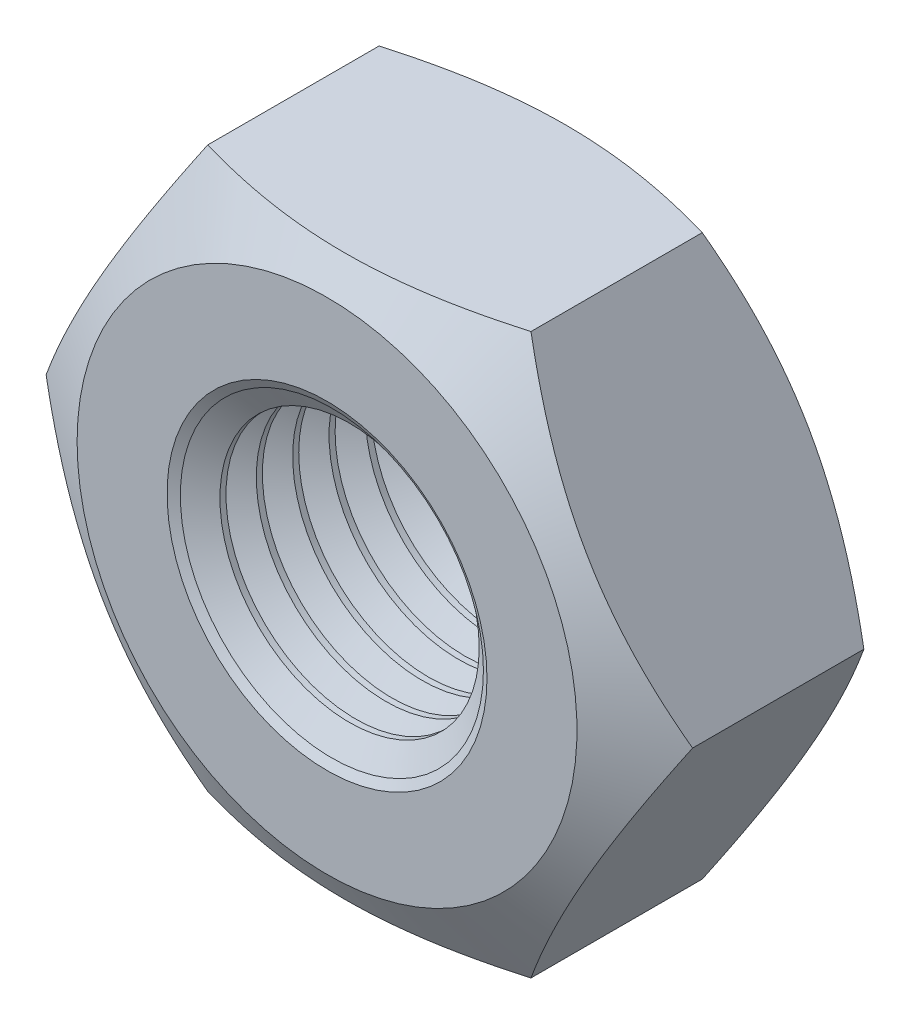
ISO-10303-21;
HEADER;
FILE_DESCRIPTION(('STEP AP214'),'2;1');
FILE_NAME('part.step','',(''),(''),'','','');
FILE_SCHEMA(('AUTOMOTIVE_DESIGN { 1 0 10303 214 1 1 1 1 }'));
ENDSEC;
DATA;
#1=APPLICATION_CONTEXT('core data for automotive mechanical design processes');
#2=APPLICATION_PROTOCOL_DEFINITION('international standard','automotive_design',2000,#1);
#3=PRODUCT_CONTEXT('',#1,'mechanical');
#4=PRODUCT('Part','Part','',(#3));
#5=PRODUCT_RELATED_PRODUCT_CATEGORY('part','',(#4));
#6=PRODUCT_DEFINITION_FORMATION('','',#4);
#7=PRODUCT_DEFINITION_CONTEXT('part definition',#1,'design');
#8=PRODUCT_DEFINITION('design','',#6,#7);
#9=PRODUCT_DEFINITION_SHAPE('','',#8);
#10=(LENGTH_UNIT() NAMED_UNIT(*) SI_UNIT(.MILLI.,.METRE.));
#11=(NAMED_UNIT(*) PLANE_ANGLE_UNIT() SI_UNIT($,.RADIAN.));
#12=(NAMED_UNIT(*) SI_UNIT($,.STERADIAN.) SOLID_ANGLE_UNIT());
#13=UNCERTAINTY_MEASURE_WITH_UNIT(LENGTH_MEASURE(1.E-05),#10,'distance_accuracy_value','');
#14=(GEOMETRIC_REPRESENTATION_CONTEXT(3) GLOBAL_UNCERTAINTY_ASSIGNED_CONTEXT((#13)) GLOBAL_UNIT_ASSIGNED_CONTEXT((#10,
#11,#12)) REPRESENTATION_CONTEXT('',''));
#15=CARTESIAN_POINT('',(0.,0.,0.));
#16=DIRECTION('',(0.,0.,1.));
#17=DIRECTION('',(1.,0.,0.));
#18=AXIS2_PLACEMENT_3D('',#15,#16,#17);
#19=CARTESIAN_POINT('',(0.,0.,-3.2));
#20=DIRECTION('',(0.,0.,1.));
#21=DIRECTION('',(1.,0.,0.));
#22=AXIS2_PLACEMENT_3D('',#19,#20,#21);
#23=CYLINDRICAL_SURFACE('',#22,1.621);
#24=CARTESIAN_POINT('',(0.,0.,-1.19130000001633));
#25=DIRECTION('',(0.,0.,1.));
#26=DIRECTION('',(1.,0.,0.));
#27=AXIS2_PLACEMENT_3D('',#24,#25,#26);
#28=CIRCLE('',#27,1.62100000000009);
#29=CARTESIAN_POINT('',(1.62100000000009,0.,-1.19130000001633));
#30=VERTEX_POINT('',#29);
#31=EDGE_CURVE('E168',#30,#30,#28,.T.);
#32=ORIENTED_EDGE('',*,*,#31,.T.);
#33=EDGE_LOOP('',(#32));
#34=FACE_BOUND('',#33,.T.);
#35=CARTESIAN_POINT('',(0.,0.,-1.26709999995001));
#36=DIRECTION('',(0.,0.,-1.));
#37=DIRECTION('',(-1.,0.,0.));
#38=AXIS2_PLACEMENT_3D('',#35,#36,#37);
#39=CIRCLE('',#38,1.62100000000009);
#40=CARTESIAN_POINT('',(-1.62100000000009,0.,-1.26709999995001));
#41=VERTEX_POINT('',#40);
#42=EDGE_CURVE('E165',#41,#41,#39,.T.);
#43=ORIENTED_EDGE('',*,*,#42,.T.);
#44=EDGE_LOOP('',(#43));
#45=FACE_BOUND('',#44,.T.);
#46=ADVANCED_FACE('F17',(#34,#45),#23,.F.);
#47=CARTESIAN_POINT('',(0.,0.,-1.00180000004002));
#48=DIRECTION('',(0.,0.,1.));
#49=DIRECTION('',(1.,0.,0.));
#50=AXIS2_PLACEMENT_3D('',#47,#48,#49);
#51=CONICAL_SURFACE('',#50,1.94922362800298,1.0471975512093);
#52=ORIENTED_EDGE('',*,*,#31,.F.);
#53=EDGE_LOOP('',(#52));
#54=FACE_BOUND('',#53,.T.);
#55=CARTESIAN_POINT('',(0.,0.,-1.00179999998318));
#56=DIRECTION('',(0.,0.,-1.));
#57=DIRECTION('',(-1.,0.,0.));
#58=AXIS2_PLACEMENT_3D('',#55,#56,#57);
#59=CIRCLE('',#58,1.94922362811667);
#60=CARTESIAN_POINT('',(-1.94922362811667,0.,-1.00179999998318));
#61=VERTEX_POINT('',#60);
#62=EDGE_CURVE('E162',#61,#61,#59,.F.);
#63=ORIENTED_EDGE('',*,*,#62,.T.);
#64=EDGE_LOOP('',(#63));
#65=FACE_BOUND('',#64,.T.);
#66=ADVANCED_FACE('F386',(#54,#65),#51,.F.);
#67=CARTESIAN_POINT('',(0.,0.,-1.45659999998315));
#68=DIRECTION('',(0.,0.,-1.));
#69=DIRECTION('',(-1.,0.,0.));
#70=AXIS2_PLACEMENT_3D('',#67,#68,#69);
#71=CONICAL_SURFACE('',#70,1.94922362811667,1.04719755122939);
#72=CARTESIAN_POINT('',(0.,0.,-1.45660000004));
#73=DIRECTION('',(0.,0.,1.));
#74=DIRECTION('',(1.,0.,0.));
#75=AXIS2_PLACEMENT_3D('',#72,#73,#74);
#76=CIRCLE('',#75,1.94922362800298);
#77=CARTESIAN_POINT('',(1.94922362800298,0.,-1.45660000004));
#78=VERTEX_POINT('',#77);
#79=EDGE_CURVE('E159',#78,#78,#76,.F.);
#80=ORIENTED_EDGE('',*,*,#79,.T.);
#81=EDGE_LOOP('',(#80));
#82=FACE_BOUND('',#81,.T.);
#83=ORIENTED_EDGE('',*,*,#42,.F.);
#84=EDGE_LOOP('',(#83));
#85=FACE_BOUND('',#84,.T.);
#86=ADVANCED_FACE('F383',(#82,#85),#71,.F.);
#87=CARTESIAN_POINT('',(0.,0.,-1.00179999998318));
#88=DIRECTION('',(0.,0.,-1.));
#89=DIRECTION('',(-1.,0.,0.));
#90=AXIS2_PLACEMENT_3D('',#87,#88,#89);
#91=CONICAL_SURFACE('',#90,1.94922362811667,1.04719755122939);
#92=CARTESIAN_POINT('',(0.,0.,-0.8123));
#93=DIRECTION('',(0.,0.,1.));
#94=DIRECTION('',(1.,0.,0.));
#95=AXIS2_PLACEMENT_3D('',#92,#93,#94);
#96=CIRCLE('',#95,1.621);
#97=CARTESIAN_POINT('',(1.621,0.,-0.8123));
#98=VERTEX_POINT('',#97);
#99=EDGE_CURVE('E156',#98,#98,#96,.T.);
#100=ORIENTED_EDGE('',*,*,#99,.T.);
#101=EDGE_LOOP('',(#100));
#102=FACE_BOUND('',#101,.T.);
#103=ORIENTED_EDGE('',*,*,#62,.F.);
#104=EDGE_LOOP('',(#103));
#105=FACE_BOUND('',#104,.T.);
#106=ADVANCED_FACE('F379',(#102,#105),#91,.F.);
#107=CARTESIAN_POINT('',(0.,0.,-1.45660000004));
#108=DIRECTION('',(0.,0.,1.));
#109=DIRECTION('',(1.,0.,0.));
#110=AXIS2_PLACEMENT_3D('',#107,#108,#109);
#111=CONICAL_SURFACE('',#110,1.94922362800298,1.0471975512093);
#112=ORIENTED_EDGE('',*,*,#79,.F.);
#113=EDGE_LOOP('',(#112));
#114=FACE_BOUND('',#113,.T.);
#115=CARTESIAN_POINT('',(0.,0.,-1.6461));
#116=DIRECTION('',(0.,0.,1.));
#117=DIRECTION('',(1.,0.,0.));
#118=AXIS2_PLACEMENT_3D('',#115,#116,#117);
#119=CIRCLE('',#118,1.621);
#120=CARTESIAN_POINT('',(1.621,0.,-1.6461));
#121=VERTEX_POINT('',#120);
#122=EDGE_CURVE('E153',#121,#121,#119,.F.);
#123=ORIENTED_EDGE('',*,*,#122,.T.);
#124=EDGE_LOOP('',(#123));
#125=FACE_BOUND('',#124,.T.);
#126=ADVANCED_FACE('F375',(#114,#125),#111,.F.);
#127=CARTESIAN_POINT('',(0.,0.,-3.2));
#128=DIRECTION('',(0.,0.,1.));
#129=DIRECTION('',(1.,0.,0.));
#130=AXIS2_PLACEMENT_3D('',#127,#128,#129);
#131=CYLINDRICAL_SURFACE('',#130,1.621);
#132=ORIENTED_EDGE('',*,*,#99,.F.);
#133=EDGE_LOOP('',(#132));
#134=FACE_BOUND('',#133,.T.);
#135=CARTESIAN_POINT('',(0.,0.,-0.736500000016349));
#136=DIRECTION('',(0.,0.,1.));
#137=DIRECTION('',(1.,0.,0.));
#138=AXIS2_PLACEMENT_3D('',#135,#136,#137);
#139=CIRCLE('',#138,1.62100000000009);
#140=CARTESIAN_POINT('',(1.62100000000009,0.,-0.736500000016349));
#141=VERTEX_POINT('',#140);
#142=EDGE_CURVE('E150',#141,#141,#139,.T.);
#143=ORIENTED_EDGE('',*,*,#142,.T.);
#144=EDGE_LOOP('',(#143));
#145=FACE_BOUND('',#144,.T.);
#146=ADVANCED_FACE('F371',(#134,#145),#131,.F.);
#147=CARTESIAN_POINT('',(0.,0.,-3.2));
#148=DIRECTION('',(0.,0.,1.));
#149=DIRECTION('',(1.,0.,0.));
#150=AXIS2_PLACEMENT_3D('',#147,#148,#149);
#151=CYLINDRICAL_SURFACE('',#150,1.621);
#152=ORIENTED_EDGE('',*,*,#122,.F.);
#153=EDGE_LOOP('',(#152));
#154=FACE_BOUND('',#153,.T.);
#155=CARTESIAN_POINT('',(0.,0.,-1.72189999994998));
#156=DIRECTION('',(0.,0.,-1.));
#157=DIRECTION('',(-1.,0.,0.));
#158=AXIS2_PLACEMENT_3D('',#155,#156,#157);
#159=CIRCLE('',#158,1.62100000000009);
#160=CARTESIAN_POINT('',(-1.62100000000009,0.,-1.72189999994998));
#161=VERTEX_POINT('',#160);
#162=EDGE_CURVE('E147',#161,#161,#159,.T.);
#163=ORIENTED_EDGE('',*,*,#162,.T.);
#164=EDGE_LOOP('',(#163));
#165=FACE_BOUND('',#164,.T.);
#166=ADVANCED_FACE('F367',(#154,#165),#151,.F.);
#167=CARTESIAN_POINT('',(0.,0.,-0.547000000040043));
#168=DIRECTION('',(0.,0.,1.));
#169=DIRECTION('',(1.,0.,0.));
#170=AXIS2_PLACEMENT_3D('',#167,#168,#169);
#171=CONICAL_SURFACE('',#170,1.94922362800298,1.0471975512093);
#172=ORIENTED_EDGE('',*,*,#142,.F.);
#173=EDGE_LOOP('',(#172));
#174=FACE_BOUND('',#173,.T.);
#175=CARTESIAN_POINT('',(0.,0.,-0.5469999999832));
#176=DIRECTION('',(0.,0.,-1.));
#177=DIRECTION('',(-1.,0.,0.));
#178=AXIS2_PLACEMENT_3D('',#175,#176,#177);
#179=CIRCLE('',#178,1.94922362811667);
#180=CARTESIAN_POINT('',(-1.94922362811667,0.,-0.5469999999832));
#181=VERTEX_POINT('',#180);
#182=EDGE_CURVE('E144',#181,#181,#179,.F.);
#183=ORIENTED_EDGE('',*,*,#182,.T.);
#184=EDGE_LOOP('',(#183));
#185=FACE_BOUND('',#184,.T.);
#186=ADVANCED_FACE('F363',(#174,#185),#171,.F.);
#187=CARTESIAN_POINT('',(0.,0.,-1.91139999998313));
#188=DIRECTION('',(0.,0.,-1.));
#189=DIRECTION('',(-1.,0.,0.));
#190=AXIS2_PLACEMENT_3D('',#187,#188,#189);
#191=CONICAL_SURFACE('',#190,1.94922362811667,1.04719755122939);
#192=CARTESIAN_POINT('',(0.,0.,-1.91139999998313));
#193=DIRECTION('',(0.,0.,1.));
#194=DIRECTION('',(1.,0.,0.));
#195=AXIS2_PLACEMENT_3D('',#192,#193,#194);
#196=CIRCLE('',#195,1.94922362800298);
#197=CARTESIAN_POINT('',(1.94922362800298,0.,-1.91139999998313));
#198=VERTEX_POINT('',#197);
#199=EDGE_CURVE('E141',#198,#198,#196,.F.);
#200=ORIENTED_EDGE('',*,*,#199,.T.);
#201=EDGE_LOOP('',(#200));
#202=FACE_BOUND('',#201,.T.);
#203=ORIENTED_EDGE('',*,*,#162,.F.);
#204=EDGE_LOOP('',(#203));
#205=FACE_BOUND('',#204,.T.);
#206=ADVANCED_FACE('F359',(#202,#205),#191,.F.);
#207=CARTESIAN_POINT('',(0.,0.,-0.5469999999832));
#208=DIRECTION('',(0.,0.,-1.));
#209=DIRECTION('',(-1.,0.,0.));
#210=AXIS2_PLACEMENT_3D('',#207,#208,#209);
#211=CONICAL_SURFACE('',#210,1.94922362811667,1.04719755122939);
#212=CARTESIAN_POINT('',(0.,0.,-0.3575));
#213=DIRECTION('',(0.,0.,1.));
#214=DIRECTION('',(1.,0.,0.));
#215=AXIS2_PLACEMENT_3D('',#212,#213,#214);
#216=CIRCLE('',#215,1.621);
#217=CARTESIAN_POINT('',(1.621,0.,-0.3575));
#218=VERTEX_POINT('',#217);
#219=EDGE_CURVE('E138',#218,#218,#216,.T.);
#220=ORIENTED_EDGE('',*,*,#219,.T.);
#221=EDGE_LOOP('',(#220));
#222=FACE_BOUND('',#221,.T.);
#223=ORIENTED_EDGE('',*,*,#182,.F.);
#224=EDGE_LOOP('',(#223));
#225=FACE_BOUND('',#224,.T.);
#226=ADVANCED_FACE('F355',(#222,#225),#211,.F.);
#227=CARTESIAN_POINT('',(0.,0.,-1.91140000009682));
#228=DIRECTION('',(0.,0.,1.));
#229=DIRECTION('',(1.,0.,0.));
#230=AXIS2_PLACEMENT_3D('',#227,#228,#229);
#231=CONICAL_SURFACE('',#230,1.94922362783245,1.04719755122939);
#232=ORIENTED_EDGE('',*,*,#199,.F.);
#233=EDGE_LOOP('',(#232));
#234=FACE_BOUND('',#233,.T.);
#235=CARTESIAN_POINT('',(0.,0.,-2.1009));
#236=DIRECTION('',(0.,0.,1.));
#237=DIRECTION('',(1.,0.,0.));
#238=AXIS2_PLACEMENT_3D('',#235,#236,#237);
#239=CIRCLE('',#238,1.621);
#240=CARTESIAN_POINT('',(1.621,0.,-2.1009));
#241=VERTEX_POINT('',#240);
#242=EDGE_CURVE('E135',#241,#241,#239,.F.);
#243=ORIENTED_EDGE('',*,*,#242,.T.);
#244=EDGE_LOOP('',(#243));
#245=FACE_BOUND('',#244,.T.);
#246=ADVANCED_FACE('F351',(#234,#245),#231,.F.);
#247=CARTESIAN_POINT('',(0.,0.,-3.2));
#248=DIRECTION('',(0.,0.,1.));
#249=DIRECTION('',(1.,0.,0.));
#250=AXIS2_PLACEMENT_3D('',#247,#248,#249);
#251=CYLINDRICAL_SURFACE('',#250,1.621);
#252=ORIENTED_EDGE('',*,*,#219,.F.);
#253=EDGE_LOOP('',(#252));
#254=FACE_BOUND('',#253,.T.);
#255=CARTESIAN_POINT('',(0.,0.,-0.281700000016372));
#256=DIRECTION('',(0.,0.,1.));
#257=DIRECTION('',(1.,0.,0.));
#258=AXIS2_PLACEMENT_3D('',#255,#256,#257);
#259=CIRCLE('',#258,1.62100000000009);
#260=CARTESIAN_POINT('',(1.62100000000009,0.,-0.281700000016372));
#261=VERTEX_POINT('',#260);
#262=EDGE_CURVE('E132',#261,#261,#259,.T.);
#263=ORIENTED_EDGE('',*,*,#262,.T.);
#264=EDGE_LOOP('',(#263));
#265=FACE_BOUND('',#264,.T.);
#266=ADVANCED_FACE('F347',(#254,#265),#251,.F.);
#267=CARTESIAN_POINT('',(0.,0.,-3.2));
#268=DIRECTION('',(0.,0.,1.));
#269=DIRECTION('',(1.,0.,0.));
#270=AXIS2_PLACEMENT_3D('',#267,#268,#269);
#271=CYLINDRICAL_SURFACE('',#270,1.621);
#272=ORIENTED_EDGE('',*,*,#242,.F.);
#273=EDGE_LOOP('',(#272));
#274=FACE_BOUND('',#273,.T.);
#275=CARTESIAN_POINT('',(0.,0.,-2.17669999994996));
#276=DIRECTION('',(0.,0.,-1.));
#277=DIRECTION('',(-1.,0.,0.));
#278=AXIS2_PLACEMENT_3D('',#275,#276,#277);
#279=CIRCLE('',#278,1.62100000000009);
#280=CARTESIAN_POINT('',(-1.62100000000009,0.,-2.17669999994996));
#281=VERTEX_POINT('',#280);
#282=EDGE_CURVE('E129',#281,#281,#279,.T.);
#283=ORIENTED_EDGE('',*,*,#282,.T.);
#284=EDGE_LOOP('',(#283));
#285=FACE_BOUND('',#284,.T.);
#286=ADVANCED_FACE('F343',(#274,#285),#271,.F.);
#287=CARTESIAN_POINT('',(0.,0.,-0.0922000000400658));
#288=DIRECTION('',(0.,0.,1.));
#289=DIRECTION('',(1.,0.,0.));
#290=AXIS2_PLACEMENT_3D('',#287,#288,#289);
#291=CONICAL_SURFACE('',#290,1.94922362800298,1.0471975512093);
#292=ORIENTED_EDGE('',*,*,#262,.F.);
#293=EDGE_LOOP('',(#292));
#294=FACE_BOUND('',#293,.T.);
#295=CARTESIAN_POINT('',(0.,0.,-0.0921999999832224));
#296=DIRECTION('',(0.,0.,-1.));
#297=DIRECTION('',(-1.,0.,0.));
#298=AXIS2_PLACEMENT_3D('',#295,#296,#297);
#299=CIRCLE('',#298,1.94922362811667);
#300=CARTESIAN_POINT('',(-1.94922362811667,0.,-0.0921999999832224));
#301=VERTEX_POINT('',#300);
#302=EDGE_CURVE('E126',#301,#301,#299,.F.);
#303=ORIENTED_EDGE('',*,*,#302,.T.);
#304=EDGE_LOOP('',(#303));
#305=FACE_BOUND('',#304,.T.);
#306=ADVANCED_FACE('F339',(#294,#305),#291,.F.);
#307=CARTESIAN_POINT('',(0.,0.,-2.36619999998311));
#308=DIRECTION('',(0.,0.,-1.));
#309=DIRECTION('',(-1.,0.,0.));
#310=AXIS2_PLACEMENT_3D('',#307,#308,#309);
#311=CONICAL_SURFACE('',#310,1.94922362811667,1.04719755122939);
#312=CARTESIAN_POINT('',(0.,0.,-2.36619999998311));
#313=DIRECTION('',(0.,0.,1.));
#314=DIRECTION('',(1.,0.,0.));
#315=AXIS2_PLACEMENT_3D('',#312,#313,#314);
#316=CIRCLE('',#315,1.94922362800298);
#317=CARTESIAN_POINT('',(1.94922362800298,0.,-2.36619999998311));
#318=VERTEX_POINT('',#317);
#319=EDGE_CURVE('E123',#318,#318,#316,.F.);
#320=ORIENTED_EDGE('',*,*,#319,.T.);
#321=EDGE_LOOP('',(#320));
#322=FACE_BOUND('',#321,.T.);
#323=ORIENTED_EDGE('',*,*,#282,.F.);
#324=EDGE_LOOP('',(#323));
#325=FACE_BOUND('',#324,.T.);
#326=ADVANCED_FACE('F335',(#322,#325),#311,.F.);
#327=CARTESIAN_POINT('',(0.,0.,-0.0921999999832224));
#328=DIRECTION('',(0.,0.,-1.));
#329=DIRECTION('',(-1.,0.,0.));
#330=AXIS2_PLACEMENT_3D('',#327,#328,#329);
#331=CONICAL_SURFACE('',#330,1.94922362811667,1.04719755154917);
#332=CARTESIAN_POINT('',(0.,0.,-0.0607578759854732));
#333=DIRECTION('',(0.,0.,1.));
#334=DIRECTION('',(1.,0.,0.));
#335=AXIS2_PLACEMENT_3D('',#332,#333,#334);
#336=CIRCLE('',#335,1.89476427181035);
#337=CARTESIAN_POINT('',(1.89476427181035,0.,-0.0607578759854732));
#338=VERTEX_POINT('',#337);
#339=EDGE_CURVE('E120',#338,#338,#336,.T.);
#340=ORIENTED_EDGE('',*,*,#339,.T.);
#341=EDGE_LOOP('',(#340));
#342=FACE_BOUND('',#341,.T.);
#343=ORIENTED_EDGE('',*,*,#302,.F.);
#344=EDGE_LOOP('',(#343));
#345=FACE_BOUND('',#344,.T.);
#346=ADVANCED_FACE('F331',(#342,#345),#331,.F.);
#347=CARTESIAN_POINT('',(0.,0.,-2.3662000000968));
#348=DIRECTION('',(0.,0.,1.));
#349=DIRECTION('',(1.,0.,0.));
#350=AXIS2_PLACEMENT_3D('',#347,#348,#349);
#351=CONICAL_SURFACE('',#350,1.94922362783245,1.04719755122939);
#352=ORIENTED_EDGE('',*,*,#319,.F.);
#353=EDGE_LOOP('',(#352));
#354=FACE_BOUND('',#353,.T.);
#355=CARTESIAN_POINT('',(0.,0.,-2.5557));
#356=DIRECTION('',(0.,0.,1.));
#357=DIRECTION('',(1.,0.,0.));
#358=AXIS2_PLACEMENT_3D('',#355,#356,#357);
#359=CIRCLE('',#358,1.621);
#360=CARTESIAN_POINT('',(1.621,0.,-2.5557));
#361=VERTEX_POINT('',#360);
#362=EDGE_CURVE('E117',#361,#361,#359,.F.);
#363=ORIENTED_EDGE('',*,*,#362,.T.);
#364=EDGE_LOOP('',(#363));
#365=FACE_BOUND('',#364,.T.);
#366=ADVANCED_FACE('F324',(#354,#365),#351,.F.);
#367=CARTESIAN_POINT('',(0.,0.,0.));
#368=DIRECTION('',(0.,0.,1.));
#369=DIRECTION('',(1.,0.,0.));
#370=AXIS2_PLACEMENT_3D('',#367,#368,#369);
#371=CONICAL_SURFACE('',#370,2.00000000000955,1.0471975513299);
#372=ORIENTED_EDGE('',*,*,#339,.F.);
#373=EDGE_LOOP('',(#372));
#374=FACE_BOUND('',#373,.T.);
#375=CARTESIAN_POINT('',(0.,0.,0.));
#376=DIRECTION('',(0.,0.,1.));
#377=DIRECTION('',(1.,0.,0.));
#378=AXIS2_PLACEMENT_3D('',#375,#376,#377);
#379=CIRCLE('',#378,2.00000000000955);
#380=CARTESIAN_POINT('',(2.00000000000955,0.,0.));
#381=VERTEX_POINT('',#380);
#382=EDGE_CURVE('E20',#381,#381,#379,.F.);
#383=ORIENTED_EDGE('',*,*,#382,.F.);
#384=EDGE_LOOP('',(#383));
#385=FACE_BOUND('',#384,.T.);
#386=ADVANCED_FACE('F316',(#374,#385),#371,.F.);
#387=CARTESIAN_POINT('',(0.,0.,-3.2));
#388=DIRECTION('',(0.,0.,1.));
#389=DIRECTION('',(1.,0.,0.));
#390=AXIS2_PLACEMENT_3D('',#387,#388,#389);
#391=CYLINDRICAL_SURFACE('',#390,1.621);
#392=ORIENTED_EDGE('',*,*,#362,.F.);
#393=EDGE_LOOP('',(#392));
#394=FACE_BOUND('',#393,.T.);
#395=CARTESIAN_POINT('',(0.,0.,-2.63149999994994));
#396=DIRECTION('',(0.,0.,-1.));
#397=DIRECTION('',(-1.,0.,0.));
#398=AXIS2_PLACEMENT_3D('',#395,#396,#397);
#399=CIRCLE('',#398,1.62100000000009);
#400=CARTESIAN_POINT('',(-1.62100000000009,0.,-2.63149999994994));
#401=VERTEX_POINT('',#400);
#402=EDGE_CURVE('E114',#401,#401,#399,.T.);
#403=ORIENTED_EDGE('',*,*,#402,.T.);
#404=EDGE_LOOP('',(#403));
#405=FACE_BOUND('',#404,.T.);
#406=ADVANCED_FACE('F314',(#394,#405),#391,.F.);
#407=CARTESIAN_POINT('',(4.04145188432738,0.,0.));
#408=DIRECTION('',(0.,0.,1.));
#409=DIRECTION('',(1.,0.,0.));
#410=AXIS2_PLACEMENT_3D('',#407,#408,#409);
#411=PLANE('',#410);
#412=CARTESIAN_POINT('',(0.,0.,0.));
#413=DIRECTION('',(0.,0.,-1.));
#414=DIRECTION('',(-1.,0.,0.));
#415=AXIS2_PLACEMENT_3D('',#412,#413,#414);
#416=CIRCLE('',#415,3.12500000001137);
#417=CARTESIAN_POINT('',(-3.12500000001137,0.,0.));
#418=VERTEX_POINT('',#417);
#419=EDGE_CURVE('E113',#418,#418,#416,.T.);
#420=ORIENTED_EDGE('',*,*,#419,.F.);
#421=EDGE_LOOP('',(#420));
#422=FACE_BOUND('',#421,.T.);
#423=ORIENTED_EDGE('',*,*,#382,.T.);
#424=EDGE_LOOP('',(#423));
#425=FACE_BOUND('',#424,.T.);
#426=ADVANCED_FACE('F311',(#422,#425),#411,.T.);
#427=CARTESIAN_POINT('',(0.,0.,-2.82099999998309));
#428=DIRECTION('',(0.,0.,-1.));
#429=DIRECTION('',(-1.,0.,0.));
#430=AXIS2_PLACEMENT_3D('',#427,#428,#429);
#431=CONICAL_SURFACE('',#430,1.94922362811667,1.04719755122939);
#432=CARTESIAN_POINT('',(0.,0.,-2.82099999998309));
#433=DIRECTION('',(0.,0.,1.));
#434=DIRECTION('',(1.,0.,0.));
#435=AXIS2_PLACEMENT_3D('',#432,#433,#434);
#436=CIRCLE('',#435,1.94922362800298);
#437=CARTESIAN_POINT('',(1.94922362800298,0.,-2.82099999998309));
#438=VERTEX_POINT('',#437);
#439=EDGE_CURVE('E88',#438,#438,#436,.F.);
#440=ORIENTED_EDGE('',*,*,#439,.T.);
#441=EDGE_LOOP('',(#440));
#442=FACE_BOUND('',#441,.T.);
#443=ORIENTED_EDGE('',*,*,#402,.F.);
#444=EDGE_LOOP('',(#443));
#445=FACE_BOUND('',#444,.T.);
#446=ADVANCED_FACE('F221',(#442,#445),#431,.F.);
#447=CARTESIAN_POINT('',(0.,0.,-0.532288424551552));
#448=DIRECTION('',(0.,0.,-1.));
#449=DIRECTION('',(-1.,0.,0.));
#450=AXIS2_PLACEMENT_3D('',#447,#448,#449);
#451=CONICAL_SURFACE('',#450,4.04695059563664,1.04719755120655);
#452=ORIENTED_EDGE('',*,*,#419,.T.);
#453=EDGE_LOOP('',(#452));
#454=FACE_BOUND('',#453,.T.);
#455=CARTESIAN_POINT('',(2.02072594216808,-3.49999999999654,-0.529113742100558));
#456=CARTESIAN_POINT('',(1.8431286077679,-3.49999999999876,-0.477830946071955));
#457=CARTESIAN_POINT('',(1.66399825570359,-3.49999999999967,-0.431191927026146));
#458=CARTESIAN_POINT('',(1.3026360293526,-3.50000000000033,-0.349784920052545));
#459=CARTESIAN_POINT('',(1.12039773644858,-3.50000000000009,-0.315045727694607));
#460=CARTESIAN_POINT('',(0.758179538450367,-3.49999999999991,-0.260971670259684));
#461=CARTESIAN_POINT('',(0.578255349656851,-3.49999999999998,-0.241276870398876));
#462=CARTESIAN_POINT('',(0.217560811004433,-3.50000000000002,-0.217769786332698));
#463=CARTESIAN_POINT('',(0.0367917712725353,-3.50000000000001,-0.213938031559148));
#464=CARTESIAN_POINT('',(-0.300955787032595,-3.5,-0.221929749874586));
#465=CARTESIAN_POINT('',(-0.457984987378499,-3.5,-0.231790991231826));
#466=CARTESIAN_POINT('',(-0.771020394052043,-3.5,-0.263039018359397));
#467=CARTESIAN_POINT('',(-0.927025518481919,-3.5,-0.284436467947364));
#468=CARTESIAN_POINT('',(-1.24070580761474,-3.5,-0.337925950443326));
#469=CARTESIAN_POINT('',(-1.3983412918714,-3.5,-0.370244615982738));
#470=CARTESIAN_POINT('',(-1.7112618071414,-3.5,-0.443594323568414));
#471=CARTESIAN_POINT('',(-1.86655084393577,-3.5,-0.484608142415303));
#472=CARTESIAN_POINT('',(-2.02072594216813,-3.5,-0.529113742098307));
#473=B_SPLINE_CURVE_WITH_KNOTS('',3,(#455,#456,#457,#458,#459,#460,#461,#462,#463,#464,#465,
#466,#467,#468,#469,#470,#471,#472),.UNSPECIFIED.,.F.,.F.,(4,2,2,2,2,2,2,2,4),(0.,
0.554778020223323,1.11088917979496,1.65323831076436,2.19492155556722,2.66648861960472,
3.13849233914197,3.6209628393595,4.10248645365815),.UNSPECIFIED.);
#474=CARTESIAN_POINT('',(2.02072594216244,-3.50000000000216,-0.529113742097746));
#475=VERTEX_POINT('',#474);
#476=CARTESIAN_POINT('',(-2.02072594216618,-3.5,-0.529113742097746));
#477=VERTEX_POINT('',#476);
#478=EDGE_CURVE('E98',#475,#477,#473,.T.);
#479=ORIENTED_EDGE('',*,*,#478,.F.);
#480=CARTESIAN_POINT('',(4.04145188432871,6.5021137772254E-12,-0.529113742100217));
#481=CARTESIAN_POINT('',(3.95265321712974,-0.153803803229199,-0.477830946072129));
#482=CARTESIAN_POINT('',(3.86308804109806,-0.308935238706024,-0.431191927026513));
#483=CARTESIAN_POINT('',(3.68240692792294,-0.621884106694241,-0.349784920053006));
#484=CARTESIAN_POINT('',(3.59128778147083,-0.779707097891313,-0.315045727694969));
#485=CARTESIAN_POINT('',(3.41017868247167,-1.09339725907067,-0.260971670259909));
#486=CARTESIAN_POINT('',(3.32021658807496,-1.24921617732116,-0.241276870399062));
#487=CARTESIAN_POINT('',(3.1398693187488,-1.56158681080043,-0.217769786332779));
#488=CARTESIAN_POINT('',(3.04948479888285,-1.71813739142594,-0.213938031559163));
#489=CARTESIAN_POINT('',(2.88061101973021,-2.01063535698448,-0.221929749874484));
#490=CARTESIAN_POINT('',(2.80209641955717,-2.14662663362015,-0.231790991231689));
#491=CARTESIAN_POINT('',(2.64557871622022,-2.41772324808374,-0.263039018359218));
#492=CARTESIAN_POINT('',(2.56757615400519,-2.55282764896072,-0.284436467947179));
#493=CARTESIAN_POINT('',(2.41073600943859,-2.82448274801651,-0.337925950443154));
#494=CARTESIAN_POINT('',(2.33191826731018,-2.96099908192079,-0.370244615982587));
#495=CARTESIAN_POINT('',(2.175458009675,-3.23199619751023,-0.443594323568325));
#496=CARTESIAN_POINT('',(2.09781349127773,-3.36648044830352,-0.484608142415255));
#497=CARTESIAN_POINT('',(2.02072594216147,-3.50000000000384,-0.529113742098306));
#498=B_SPLINE_CURVE_WITH_KNOTS('',3,(#480,#481,#482,#483,#484,#485,#486,#487,#488,#489,#490,
#491,#492,#493,#494,#495,#496,#497),.UNSPECIFIED.,.F.,.F.,(4,2,2,2,2,2,2,2,4),(0.,
0.554778020223197,1.11088917979474,1.65323831076407,2.19492155556686,2.66648861960489,
3.13849233914267,3.62096283936074,4.10248645365992),.UNSPECIFIED.);
#499=CARTESIAN_POINT('',(4.04145188433753,0.,-0.529113742107598));
#500=VERTEX_POINT('',#499);
#501=EDGE_CURVE('E102',#500,#475,#498,.T.);
#502=ORIENTED_EDGE('',*,*,#501,.F.);
#503=CARTESIAN_POINT('',(2.0207259421585,3.50000000000207,-0.529113742100557));
#504=CARTESIAN_POINT('',(2.10952460936051,3.34619619676822,-0.477830946071955));
#505=CARTESIAN_POINT('',(2.19908978539345,3.19106476129214,-0.431191927026146));
#506=CARTESIAN_POINT('',(2.37977089856952,2.87811589330441,-0.349784920052544));
#507=CARTESIAN_POINT('',(2.47089004502132,2.72029290210709,-0.315045727694606));
#508=CARTESIAN_POINT('',(2.65199914402028,2.40660274092753,-0.260971670259684));
#509=CARTESIAN_POINT('',(2.74196123841709,2.25078382267707,-0.241276870398876));
#510=CARTESIAN_POINT('',(2.92230850774334,1.93841318919779,-0.217769786332698));
#511=CARTESIAN_POINT('',(3.01269302760927,1.78186260857224,-0.213938031559148));
#512=CARTESIAN_POINT('',(3.18156680676191,1.48936464301369,-0.22192974987459));
#513=CARTESIAN_POINT('',(3.26008140693494,1.35337336637805,-0.231790991231846));
#514=CARTESIAN_POINT('',(3.41659911027187,1.08227675191449,-0.263039018359472));
#515=CARTESIAN_POINT('',(3.49460167248689,0.947172351037533,-0.284436467947477));
#516=CARTESIAN_POINT('',(3.65144181705346,0.675517251981785,-0.337925950443536));
#517=CARTESIAN_POINT('',(3.73025955918187,0.539000918077519,-0.370244615983007));
#518=CARTESIAN_POINT('',(3.88671981681703,0.268003802488108,-0.443594323568812));
#519=CARTESIAN_POINT('',(3.96436433521429,0.133519551694835,-0.484608142415773));
#520=CARTESIAN_POINT('',(4.04145188433054,-5.47792073675768E-12,-0.529113742098852));
#521=B_SPLINE_CURVE_WITH_KNOTS('',3,(#503,#504,#505,#506,#507,#508,#509,#510,#511,#512,#513,
#514,#515,#516,#517,#518,#519,#520),.UNSPECIFIED.,.F.,.F.,(4,2,2,2,2,2,2,2,4),(0.,
0.554778020223325,1.11088917979496,1.65323831076436,2.19492155556722,2.6664886196052,
3.13849233914292,3.62096283936096,4.10248645366012),.UNSPECIFIED.);
#522=CARTESIAN_POINT('',(2.02072594216618,3.5,-0.529113742097745));
#523=VERTEX_POINT('',#522);
#524=EDGE_CURVE('E106',#523,#500,#521,.T.);
#525=ORIENTED_EDGE('',*,*,#524,.F.);
#526=CARTESIAN_POINT('',(-2.02072594216808,3.49999999999654,-0.529113742100557));
#527=CARTESIAN_POINT('',(-1.8431286077679,3.49999999999876,-0.477830946071955));
#528=CARTESIAN_POINT('',(-1.66399825570359,3.49999999999967,-0.431191927026146));
#529=CARTESIAN_POINT('',(-1.3026360293526,3.50000000000033,-0.349784920052545));
#530=CARTESIAN_POINT('',(-1.12039773644858,3.50000000000009,-0.315045727694607));
#531=CARTESIAN_POINT('',(-0.758179538450365,3.49999999999991,-0.260971670259684));
#532=CARTESIAN_POINT('',(-0.57825534965685,3.49999999999998,-0.241276870398876));
#533=CARTESIAN_POINT('',(-0.217560811004432,3.50000000000002,-0.217769786332698));
#534=CARTESIAN_POINT('',(-0.0367917712725343,3.50000000000001,-0.213938031559148));
#535=CARTESIAN_POINT('',(0.300955787032595,3.49999999999999,-0.221929749874586));
#536=CARTESIAN_POINT('',(0.457984987378499,3.5,-0.231790991231826));
#537=CARTESIAN_POINT('',(0.771020394052044,3.5,-0.263039018359397));
#538=CARTESIAN_POINT('',(0.92702551848192,3.5,-0.284436467947364));
#539=CARTESIAN_POINT('',(1.24070580761474,3.5,-0.337925950443326));
#540=CARTESIAN_POINT('',(1.3983412918714,3.5,-0.370244615982738));
#541=CARTESIAN_POINT('',(1.7112618071414,3.5,-0.443594323568413));
#542=CARTESIAN_POINT('',(1.86655084393577,3.5,-0.484608142415303));
#543=CARTESIAN_POINT('',(2.02072594216813,3.5,-0.529113742098307));
#544=B_SPLINE_CURVE_WITH_KNOTS('',3,(#526,#527,#528,#529,#530,#531,#532,#533,#534,#535,#536,
#537,#538,#539,#540,#541,#542,#543),.UNSPECIFIED.,.F.,.F.,(4,2,2,2,2,2,2,2,4),(0.,
0.554778020223322,1.11088917979496,1.65323831076436,2.19492155556722,2.66648861960472,
3.13849233914196,3.6209628393595,4.10248645365815),.UNSPECIFIED.);
#545=CARTESIAN_POINT('',(-2.02072594216244,3.50000000000216,-0.529113742097746));
#546=VERTEX_POINT('',#545);
#547=EDGE_CURVE('E84',#546,#523,#544,.T.);
#548=ORIENTED_EDGE('',*,*,#547,.F.);
#549=CARTESIAN_POINT('',(-4.04145188432871,-6.5008529185515E-12,-0.529113742100217));
#550=CARTESIAN_POINT('',(-3.95265321712974,0.153803803229201,-0.477830946072128));
#551=CARTESIAN_POINT('',(-3.86308804109806,0.308935238706025,-0.431191927026513));
#552=CARTESIAN_POINT('',(-3.68240692792294,0.621884106694242,-0.349784920053006));
#553=CARTESIAN_POINT('',(-3.59128778147083,0.779707097891313,-0.315045727694968));
#554=CARTESIAN_POINT('',(-3.41017868247167,1.09339725907067,-0.260971670259908));
#555=CARTESIAN_POINT('',(-3.32021658807496,1.24921617732116,-0.241276870399062));
#556=CARTESIAN_POINT('',(-3.1398693187488,1.56158681080043,-0.217769786332779));
#557=CARTESIAN_POINT('',(-3.04948479888285,1.71813739142595,-0.213938031559162));
#558=CARTESIAN_POINT('',(-2.88061101973021,2.01063535698448,-0.221929749874484));
#559=CARTESIAN_POINT('',(-2.80209641955717,2.14662663362015,-0.231790991231689));
#560=CARTESIAN_POINT('',(-2.64557871622022,2.41772324808374,-0.263039018359218));
#561=CARTESIAN_POINT('',(-2.56757615400519,2.55282764896072,-0.284436467947179));
#562=CARTESIAN_POINT('',(-2.41073600943859,2.82448274801651,-0.337925950443154));
#563=CARTESIAN_POINT('',(-2.33191826731018,2.96099908192079,-0.370244615982588));
#564=CARTESIAN_POINT('',(-2.175458009675,3.23199619751023,-0.443594323568325));
#565=CARTESIAN_POINT('',(-2.09781349127773,3.36648044830352,-0.484608142415255));
#566=CARTESIAN_POINT('',(-2.02072594216147,3.50000000000384,-0.529113742098307));
#567=B_SPLINE_CURVE_WITH_KNOTS('',3,(#549,#550,#551,#552,#553,#554,#555,#556,#557,#558,#559,
#560,#561,#562,#563,#564,#565,#566),.UNSPECIFIED.,.F.,.F.,(4,2,2,2,2,2,2,2,4),(0.,
0.554778020223197,1.11088917979473,1.65323831076407,2.19492155556686,2.66648861960489,
3.13849233914267,3.62096283936074,4.10248645365991),.UNSPECIFIED.);
#568=CARTESIAN_POINT('',(-4.0414518843392,2.88424168062007E-12,-0.529113742108559));
#569=VERTEX_POINT('',#568);
#570=EDGE_CURVE('E81',#569,#546,#567,.T.);
#571=ORIENTED_EDGE('',*,*,#570,.F.);
#572=CARTESIAN_POINT('',(-2.0207259421585,-3.50000000000207,-0.529113742100557));
#573=CARTESIAN_POINT('',(-2.10952460936051,-3.34619619676822,-0.477830946071955));
#574=CARTESIAN_POINT('',(-2.19908978539345,-3.19106476129214,-0.431191927026146));
#575=CARTESIAN_POINT('',(-2.37977089856952,-2.87811589330441,-0.349784920052544));
#576=CARTESIAN_POINT('',(-2.47089004502132,-2.72029290210709,-0.315045727694606));
#577=CARTESIAN_POINT('',(-2.65199914402028,-2.40660274092753,-0.260971670259684));
#578=CARTESIAN_POINT('',(-2.74196123841709,-2.25078382267707,-0.241276870398876));
#579=CARTESIAN_POINT('',(-2.92230850774334,-1.93841318919779,-0.217769786332698));
#580=CARTESIAN_POINT('',(-3.01269302760927,-1.78186260857224,-0.213938031559148));
#581=CARTESIAN_POINT('',(-3.18156680676191,-1.48936464301369,-0.22192974987459));
#582=CARTESIAN_POINT('',(-3.26008140693494,-1.35337336637805,-0.231790991231846));
#583=CARTESIAN_POINT('',(-3.41659911027188,-1.08227675191449,-0.263039018359471));
#584=CARTESIAN_POINT('',(-3.49460167248689,-0.947172351037532,-0.284436467947477));
#585=CARTESIAN_POINT('',(-3.65144181705346,-0.675517251981784,-0.337925950443535));
#586=CARTESIAN_POINT('',(-3.73025955918187,-0.539000918077518,-0.370244615983006));
#587=CARTESIAN_POINT('',(-3.88671981681703,-0.268003802488107,-0.443594323568812));
#588=CARTESIAN_POINT('',(-3.96436433521429,-0.133519551694833,-0.484608142415773));
#589=CARTESIAN_POINT('',(-4.04145188433054,5.47939110863857E-12,-0.529113742098852));
#590=B_SPLINE_CURVE_WITH_KNOTS('',3,(#572,#573,#574,#575,#576,#577,#578,#579,#580,#581,#582,
#583,#584,#585,#586,#587,#588,#589),.UNSPECIFIED.,.F.,.F.,(4,2,2,2,2,2,2,2,4),(0.,
0.554778020223326,1.11088917979496,1.65323831076436,2.19492155556722,2.6664886196052,
3.13849233914292,3.62096283936097,4.10248645366012),.UNSPECIFIED.);
#591=EDGE_CURVE('E67',#477,#569,#590,.T.);
#592=ORIENTED_EDGE('',*,*,#591,.F.);
#593=EDGE_LOOP('',(#479,#502,#525,#548,#571,#592));
#594=FACE_BOUND('',#593,.T.);
#595=ADVANCED_FACE('F82',(#454,#594),#451,.T.);
#596=CARTESIAN_POINT('',(0.,0.,-2.82100000009677));
#597=DIRECTION('',(0.,0.,1.));
#598=DIRECTION('',(1.,0.,0.));
#599=AXIS2_PLACEMENT_3D('',#596,#597,#598);
#600=CONICAL_SURFACE('',#599,1.94922362783245,1.0471975511794);
#601=ORIENTED_EDGE('',*,*,#439,.F.);
#602=EDGE_LOOP('',(#601));
#603=FACE_BOUND('',#602,.T.);
#604=CARTESIAN_POINT('',(0.,0.,-2.96312499995111));
#605=DIRECTION('',(0.,0.,-1.));
#606=DIRECTION('',(-1.,0.,0.));
#607=AXIS2_PLACEMENT_3D('',#604,#605,#606);
#608=CIRCLE('',#607,1.70305590700082);
#609=CARTESIAN_POINT('',(-1.70305590700082,0.,-2.96312499995111));
#610=VERTEX_POINT('',#609);
#611=EDGE_CURVE('E93',#610,#610,#608,.T.);
#612=ORIENTED_EDGE('',*,*,#611,.T.);
#613=EDGE_LOOP('',(#612));
#614=FACE_BOUND('',#613,.T.);
#615=ADVANCED_FACE('F220',(#603,#614),#600,.F.);
#616=CARTESIAN_POINT('',(-2.02072594216369,3.5,-3.2));
#617=DIRECTION('',(-0.866025403784439,0.5,0.));
#618=DIRECTION('',(-0.5,-0.866025403784439,0.));
#619=AXIS2_PLACEMENT_3D('',#616,#617,#618);
#620=PLANE('',#619);
#621=CARTESIAN_POINT('',(-4.04145188432474,4.56779896336981E-12,-2.67088625792112));
#622=CARTESIAN_POINT('',(-3.95265321714031,0.153803803212401,-2.72216905393999));
#623=CARTESIAN_POINT('',(-3.86308804112409,0.30893523866135,-2.76880807297831));
#624=CARTESIAN_POINT('',(-3.68240692798299,0.621884106589828,-2.85021507994121));
#625=CARTESIAN_POINT('',(-3.59128778154948,0.779707097754984,-2.88495427229621));
#626=CARTESIAN_POINT('',(-3.41017868255314,1.09339725892966,-2.93902832974216));
#627=CARTESIAN_POINT('',(-3.32021658814023,1.24921617720814,-2.9587231296114));
#628=CARTESIAN_POINT('',(-3.13986931877879,1.56158681074846,-2.98223021368747));
#629=CARTESIAN_POINT('',(-3.04948479889376,1.71813739140705,-2.98606196846222));
#630=CARTESIAN_POINT('',(-2.88061102382554,2.01063534989116,-2.97807025034185));
#631=CARTESIAN_POINT('',(-2.80209642774722,2.14662661943456,-2.96820900982207));
#632=CARTESIAN_POINT('',(-2.64557873253168,2.41772321983145,-2.93696098552201));
#633=CARTESIAN_POINT('',(-2.56757617434319,2.55282761373426,-2.91556353792681));
#634=CARTESIAN_POINT('',(-2.41073603792287,2.8244826986803,-2.86207406039985));
#635=CARTESIAN_POINT('',(-2.33191829991018,2.96099902545593,-2.82975539787266));
#636=CARTESIAN_POINT('',(-2.17545805035676,3.23199612704736,-2.75640569696661));
#637=CARTESIAN_POINT('',(-2.09781353592605,3.36648037097036,-2.71539188178314));
#638=CARTESIAN_POINT('',(-2.02072599072075,3.49999991589671,-2.67088628595403));
#639=B_SPLINE_CURVE_WITH_KNOTS('',3,(#621,#622,#623,#624,#625,#626,#627,#628,#629,#630,#631,
#632,#633,#634,#635,#636,#637,#638),.UNSPECIFIED.,.F.,.F.,(4,2,2,2,2,2,2,2,4),(0.,
0.554778020125287,1.11088917958637,1.65323831065575,2.19492155556771,2.66648859500267,
3.13849228984638,3.62096276408835,4.10248635260914),.UNSPECIFIED.);
#640=CARTESIAN_POINT('',(-4.04145188431824,0.,-2.67088625792253));
#641=VERTEX_POINT('',#640);
#642=CARTESIAN_POINT('',(-2.02072596701558,3.49999995695527,-2.67088627226784));
#643=VERTEX_POINT('',#642);
#644=EDGE_CURVE('E91',#641,#643,#639,.T.);
#645=ORIENTED_EDGE('',*,*,#644,.F.);
#646=DIRECTION('',(0.,0.,1.));
#647=VECTOR('',#646,1.);
#648=CARTESIAN_POINT('',(-4.04145188432738,0.,-3.2));
#649=LINE('',#648,#647);
#650=EDGE_CURVE('E72',#569,#641,#649,.F.);
#651=ORIENTED_EDGE('',*,*,#650,.F.);
#652=ORIENTED_EDGE('',*,*,#570,.T.);
#653=DIRECTION('',(0.,0.,1.));
#654=VECTOR('',#653,1.);
#655=CARTESIAN_POINT('',(-2.02072594216369,3.5,-3.2));
#656=LINE('',#655,#654);
#657=EDGE_CURVE('E107',#643,#546,#656,.T.);
#658=ORIENTED_EDGE('',*,*,#657,.F.);
#659=EDGE_LOOP('',(#645,#651,#652,#658));
#660=FACE_BOUND('',#659,.T.);
#661=ADVANCED_FACE('F90',(#660),#620,.T.);
#662=CARTESIAN_POINT('',(2.02072594216369,3.5,-3.2));
#663=DIRECTION('',(0.,1.,0.));
#664=DIRECTION('',(0.,0.,1.));
#665=AXIS2_PLACEMENT_3D('',#662,#663,#664);
#666=PLANE('',#665);
#667=CARTESIAN_POINT('',(-2.0207260087977,3.5,-2.67088623868401));
#668=CARTESIAN_POINT('',(-1.84312867332595,3.5,-2.72216903627677));
#669=CARTESIAN_POINT('',(-1.66399832018365,3.5,-2.76880805698824));
#670=CARTESIAN_POINT('',(-1.3026360915739,3.5,-2.85021506742674));
#671=CARTESIAN_POINT('',(-1.1203977974885,3.5,-2.88495426158219));
#672=CARTESIAN_POINT('',(-0.758179597061255,3.5,-2.93902832259935));
#673=CARTESIAN_POINT('',(-0.578255407023602,3.5,-2.95872312424641));
#674=CARTESIAN_POINT('',(-0.21756086573528,3.5,-2.98223021175441));
#675=CARTESIAN_POINT('',(-0.0367918246118689,3.5,-2.98606196818453));
#676=CARTESIAN_POINT('',(0.300955731180532,3.5,-2.97807025281282));
#677=CARTESIAN_POINT('',(0.457984927617135,3.5,-2.96820901318805));
#678=CARTESIAN_POINT('',(0.771020326622062,3.5,-2.936960989962));
#679=CARTESIAN_POINT('',(0.927025447292851,3.5,-2.91556354254425));
#680=CARTESIAN_POINT('',(1.24070572887389,3.5,-2.86207406471191));
#681=CARTESIAN_POINT('',(1.39834120934261,3.5,-2.8297554016788));
#682=CARTESIAN_POINT('',(1.71126171719929,3.5,-2.75640569923264));
#683=CARTESIAN_POINT('',(1.86655075036766,3.5,-2.7153918830171));
#684=CARTESIAN_POINT('',(2.02072584501735,3.5,-2.67088628596333));
#685=B_SPLINE_CURVE_WITH_KNOTS('',3,(#667,#668,#669,#670,#671,#672,#673,#674,#675,#676,#677,
#678,#679,#680,#681,#682,#683,#684),.UNSPECIFIED.,.F.,.F.,(4,2,2,2,2,2,2,2,4),(0.,
0.554778024620495,1.11088918869307,1.65323832395775,2.1949215730215,2.66648862505913,
3.13849233255417,3.62096282013326,4.10248642190598),.UNSPECIFIED.);
#686=CARTESIAN_POINT('',(2.02072589244526,3.5,-2.67088627227207));
#687=VERTEX_POINT('',#686);
#688=EDGE_CURVE('E259',#643,#687,#685,.T.);
#689=ORIENTED_EDGE('',*,*,#688,.F.);
#690=ORIENTED_EDGE('',*,*,#657,.T.);
#691=ORIENTED_EDGE('',*,*,#547,.T.);
#692=DIRECTION('',(0.,0.,1.));
#693=VECTOR('',#692,1.);
#694=CARTESIAN_POINT('',(2.02072594216369,3.5,-3.2));
#695=LINE('',#694,#693);
#696=EDGE_CURVE('E103',#687,#523,#695,.T.);
#697=ORIENTED_EDGE('',*,*,#696,.F.);
#698=EDGE_LOOP('',(#689,#690,#691,#697));
#699=FACE_BOUND('',#698,.T.);
#700=ADVANCED_FACE('F251',(#699),#666,.T.);
#701=CARTESIAN_POINT('',(4.04145188432738,0.,-3.2));
#702=DIRECTION('',(0.866025403784438,0.5,0.));
#703=DIRECTION('',(-0.5,0.866025403784438,0.));
#704=AXIS2_PLACEMENT_3D('',#701,#702,#703);
#705=PLANE('',#704);
#706=CARTESIAN_POINT('',(2.02072590885908,3.50000005768528,-2.67088623869117));
#707=CARTESIAN_POINT('',(2.10952457661053,3.34619625349533,-2.72216903629233));
#708=CARTESIAN_POINT('',(2.19908975319745,3.1910648170579,-2.76880805701067));
#709=CARTESIAN_POINT('',(2.37977086753635,2.87811594705477,-2.85021506745906));
#710=CARTESIAN_POINT('',(2.47089001459734,2.72029295480281,-2.88495426161725));
#711=CARTESIAN_POINT('',(2.65199911481329,2.40660279151569,-2.93902832262251));
#712=CARTESIAN_POINT('',(2.74196120981574,2.2507838722161,-2.95872312426048));
#713=CARTESIAN_POINT('',(2.9223084804242,1.93841323651589,-2.98223021175707));
#714=CARTESIAN_POINT('',(3.01269300096657,1.78186265471875,-2.98606196818515));
#715=CARTESIAN_POINT('',(3.1815667829466,1.48936468426302,-2.97807025261664));
#716=CARTESIAN_POINT('',(3.26008138525928,1.3533734039214,-2.96820901215353));
#717=CARTESIAN_POINT('',(3.41659909288244,1.08227678203388,-2.93696098609818));
#718=CARTESIAN_POINT('',(3.494601657244,0.947172377439,-2.91556353668675));
#719=CARTESIAN_POINT('',(3.65144180618002,0.675517270815131,-2.86207405388354));
#720=CARTESIAN_POINT('',(3.73025955052973,0.53900093306346,-2.82975538783725));
#721=CARTESIAN_POINT('',(3.88671981253903,0.268003809897817,-2.75640567870957));
#722=CARTESIAN_POINT('',(3.96436433308936,0.133519555375316,-2.71539185882968));
#723=CARTESIAN_POINT('',(4.04145188432474,4.56752554904682E-12,-2.67088625792112));
#724=B_SPLINE_CURVE_WITH_KNOTS('',3,(#706,#707,#708,#709,#710,#711,#712,#713,#714,#715,#716,
#717,#718,#719,#720,#721,#722,#723),.UNSPECIFIED.,.F.,.F.,(4,2,2,2,2,2,2,2,4),(0.,
0.554778024717107,1.11088918889888,1.65323832406201,2.19492157301506,2.66648864965387,
3.1384923818411,3.62096289539462,4.102486522944),.UNSPECIFIED.);
#725=CARTESIAN_POINT('',(4.04145188435682,0.,-2.67088625790279));
#726=VERTEX_POINT('',#725);
#727=EDGE_CURVE('E265',#687,#726,#724,.T.);
#728=ORIENTED_EDGE('',*,*,#727,.F.);
#729=ORIENTED_EDGE('',*,*,#696,.T.);
#730=ORIENTED_EDGE('',*,*,#524,.T.);
#731=DIRECTION('',(0.,0.,1.));
#732=VECTOR('',#731,1.);
#733=CARTESIAN_POINT('',(4.04145188432738,0.,-3.2));
#734=LINE('',#733,#732);
#735=EDGE_CURVE('E99',#726,#500,#734,.T.);
#736=ORIENTED_EDGE('',*,*,#735,.F.);
#737=EDGE_LOOP('',(#728,#729,#730,#736));
#738=FACE_BOUND('',#737,.T.);
#739=ADVANCED_FACE('F255',(#738),#705,.T.);
#740=CARTESIAN_POINT('',(2.02072594216369,-3.5,-3.2));
#741=DIRECTION('',(0.866025403784439,-0.5,0.));
#742=DIRECTION('',(0.5,0.866025403784439,0.));
#743=AXIS2_PLACEMENT_3D('',#740,#741,#742);
#744=PLANE('',#743);
#745=CARTESIAN_POINT('',(4.04145188432474,-4.5665049855772E-12,-2.67088625792112));
#746=CARTESIAN_POINT('',(3.95265321714032,-0.153803803212392,-2.72216905393999));
#747=CARTESIAN_POINT('',(3.8630880411241,-0.308935238661333,-2.7688080729783));
#748=CARTESIAN_POINT('',(3.68240692798301,-0.621884106589794,-2.8502150799412));
#749=CARTESIAN_POINT('',(3.5912877815495,-0.779707097754942,-2.8849542722962));
#750=CARTESIAN_POINT('',(3.41017868255317,-1.09339725892962,-2.93902832974216));
#751=CARTESIAN_POINT('',(3.32021658814025,-1.2492161772081,-2.9587231296114));
#752=CARTESIAN_POINT('',(3.1398693187788,-1.56158681074844,-2.98223021368747));
#753=CARTESIAN_POINT('',(3.04948479889376,-1.71813739140704,-2.98606196846222));
#754=CARTESIAN_POINT('',(2.88061102382668,-2.01063534988919,-2.9780702503419));
#755=CARTESIAN_POINT('',(2.80209642774949,-2.14662661943063,-2.96820900982236));
#756=CARTESIAN_POINT('',(2.6455787325362,-2.41772321982363,-2.93696098552307));
#757=CARTESIAN_POINT('',(2.56757617434883,-2.55282761372451,-2.91556353792843));
#758=CARTESIAN_POINT('',(2.41073603793076,-2.82448269866664,-2.86207406040285));
#759=CARTESIAN_POINT('',(2.33191829991921,-2.96099902544029,-2.82975539787649));
#760=CARTESIAN_POINT('',(2.17545805036802,-3.23199612702785,-2.75640569697229));
#761=CARTESIAN_POINT('',(2.09781353593841,-3.36648037094895,-2.71539188178984));
#762=CARTESIAN_POINT('',(2.02072599073419,-3.49999991587342,-2.67088628596179));
#763=B_SPLINE_CURVE_WITH_KNOTS('',3,(#745,#746,#747,#748,#749,#750,#751,#752,#753,#754,#755,
#756,#757,#758,#759,#760,#761,#762),.UNSPECIFIED.,.F.,.F.,(4,2,2,2,2,2,2,2,4),(0.,
0.55477802012526,1.11088917958632,1.65323831065572,2.19492155556771,2.66648859499586,
3.13849228983274,3.62096276406751,4.10248635258117),.UNSPECIFIED.);
#764=CARTESIAN_POINT('',(2.0207259670215,-3.49999995694501,-2.67088627227126));
#765=VERTEX_POINT('',#764);
#766=EDGE_CURVE('E270',#726,#765,#763,.T.);
#767=ORIENTED_EDGE('',*,*,#766,.F.);
#768=ORIENTED_EDGE('',*,*,#735,.T.);
#769=ORIENTED_EDGE('',*,*,#501,.T.);
#770=DIRECTION('',(0.,0.,1.));
#771=VECTOR('',#770,1.);
#772=CARTESIAN_POINT('',(2.02072594216369,-3.5,-3.2));
#773=LINE('',#772,#771);
#774=EDGE_CURVE('E77',#765,#475,#773,.T.);
#775=ORIENTED_EDGE('',*,*,#774,.F.);
#776=EDGE_LOOP('',(#767,#768,#769,#775));
#777=FACE_BOUND('',#776,.T.);
#778=ADVANCED_FACE('F275',(#777),#744,.T.);
#779=CARTESIAN_POINT('',(-2.02072594216369,-3.5,-3.2));
#780=DIRECTION('',(0.,-1.,0.));
#781=DIRECTION('',(1.,0.,0.));
#782=AXIS2_PLACEMENT_3D('',#779,#780,#781);
#783=PLANE('',#782);
#784=CARTESIAN_POINT('',(2.0207260087673,-3.5,-2.67088623869279));
#785=CARTESIAN_POINT('',(1.84312867329605,-3.5,-2.72216903628482));
#786=CARTESIAN_POINT('',(1.66399832015426,-3.5,-2.76880805699553));
#787=CARTESIAN_POINT('',(1.30263609154558,-3.5,-2.85021506743245));
#788=CARTESIAN_POINT('',(1.12039779746073,-3.5,-2.88495426158708));
#789=CARTESIAN_POINT('',(0.758179597034595,-3.5,-2.9390283226026));
#790=CARTESIAN_POINT('',(0.578255406997493,-3.5,-2.95872312424886));
#791=CARTESIAN_POINT('',(0.217560865710341,-3.5,-2.98223021175529));
#792=CARTESIAN_POINT('',(0.0367918245875467,-3.5,-2.98606196818466));
#793=CARTESIAN_POINT('',(-0.300955731202185,-3.5,-2.9780702528117));
#794=CARTESIAN_POINT('',(-0.457984927636746,-3.5,-2.96820901318652));
#795=CARTESIAN_POINT('',(-0.771020326637584,-3.5,-2.93696098996001));
#796=CARTESIAN_POINT('',(-0.927025447306325,-3.5,-2.91556354254221));
#797=CARTESIAN_POINT('',(-1.2407057288832,-3.5,-2.86207406471007));
#798=CARTESIAN_POINT('',(-1.3983412093498,-3.5,-2.82975540167722));
#799=CARTESIAN_POINT('',(-1.71126171720231,-3.5,-2.75640569923183));
#800=CARTESIAN_POINT('',(-1.86655075036863,-3.5,-2.7153918830168));
#801=CARTESIAN_POINT('',(-2.0207258450163,-3.5,-2.67088628596363));
#802=B_SPLINE_CURVE_WITH_KNOTS('',3,(#784,#785,#786,#787,#788,#789,#790,#791,#792,#793,#794,
#795,#796,#797,#798,#799,#800,#801),.UNSPECIFIED.,.F.,.F.,(4,2,2,2,2,2,2,2,4),(0.,
0.554778024618444,1.11088918868892,1.65323832395168,2.19492157301354,2.66648862504515,
3.13849233253415,3.62096282010687,4.10248642187326),.UNSPECIFIED.);
#803=CARTESIAN_POINT('',(-2.02072589244471,-3.5,-2.67088627227223));
#804=VERTEX_POINT('',#803);
#805=EDGE_CURVE('E35',#765,#804,#802,.T.);
#806=ORIENTED_EDGE('',*,*,#805,.F.);
#807=ORIENTED_EDGE('',*,*,#774,.T.);
#808=ORIENTED_EDGE('',*,*,#478,.T.);
#809=DIRECTION('',(0.,0.,1.));
#810=VECTOR('',#809,1.);
#811=CARTESIAN_POINT('',(-2.02072594216369,-3.5,-3.2));
#812=LINE('',#811,#810);
#813=EDGE_CURVE('E74',#804,#477,#812,.T.);
#814=ORIENTED_EDGE('',*,*,#813,.F.);
#815=EDGE_LOOP('',(#806,#807,#808,#814));
#816=FACE_BOUND('',#815,.T.);
#817=ADVANCED_FACE('F194',(#816),#783,.T.);
#818=CARTESIAN_POINT('',(-4.04145188432738,0.,-3.2));
#819=DIRECTION('',(-0.866025403784439,-0.5,0.));
#820=DIRECTION('',(0.5,-0.866025403784439,0.));
#821=AXIS2_PLACEMENT_3D('',#818,#819,#820);
#822=PLANE('',#821);
#823=CARTESIAN_POINT('',(-2.02072590885853,-3.50000005768624,-2.67088623869085));
#824=CARTESIAN_POINT('',(-2.10952457660999,-3.34619625349627,-2.72216903629204));
#825=CARTESIAN_POINT('',(-2.19908975319692,-3.19106481705883,-2.76880805701041));
#826=CARTESIAN_POINT('',(-2.37977086753584,-2.87811594705567,-2.85021506745885));
#827=CARTESIAN_POINT('',(-2.47089001459683,-2.72029295480368,-2.88495426161707));
#828=CARTESIAN_POINT('',(-2.65199911481281,-2.40660279151652,-2.93902832262239));
#829=CARTESIAN_POINT('',(-2.74196120981527,-2.25078387221692,-2.95872312426039));
#830=CARTESIAN_POINT('',(-2.92230848042375,-1.93841323651667,-2.98223021175704));
#831=CARTESIAN_POINT('',(-3.01269300096613,-1.78186265471951,-2.98606196818514));
#832=CARTESIAN_POINT('',(-3.18156678294621,-1.4893646842637,-2.97807025261668));
#833=CARTESIAN_POINT('',(-3.26008138525892,-1.35337340392202,-2.96820901215358));
#834=CARTESIAN_POINT('',(-3.41659909288215,-1.08227678203438,-2.93696098609826));
#835=CARTESIAN_POINT('',(-3.49460165724374,-0.947172377439436,-2.91556353668683));
#836=CARTESIAN_POINT('',(-3.65144180617984,-0.675517270815441,-2.86207405388361));
#837=CARTESIAN_POINT('',(-3.73025955052959,-0.539000933063707,-2.82975538783731));
#838=CARTESIAN_POINT('',(-3.88671981253896,-0.268003809897938,-2.75640567870961));
#839=CARTESIAN_POINT('',(-3.96436433308933,-0.133519555375375,-2.7153918588297));
#840=CARTESIAN_POINT('',(-4.04145188432474,-4.56563659085031E-12,-2.67088625792112));
#841=B_SPLINE_CURVE_WITH_KNOTS('',3,(#823,#824,#825,#826,#827,#828,#829,#830,#831,#832,#833,
#834,#835,#836,#837,#838,#839,#840),.UNSPECIFIED.,.F.,.F.,(4,2,2,2,2,2,2,2,4),(0.,
0.554778024717182,1.11088918889903,1.65323832406223,2.19492157301535,2.66648864965437,
3.13849238184181,3.62096289539555,4.10248652294515),.UNSPECIFIED.);
#842=EDGE_CURVE('E173',#804,#641,#841,.T.);
#843=ORIENTED_EDGE('',*,*,#842,.F.);
#844=ORIENTED_EDGE('',*,*,#813,.T.);
#845=ORIENTED_EDGE('',*,*,#591,.T.);
#846=ORIENTED_EDGE('',*,*,#650,.T.);
#847=EDGE_LOOP('',(#843,#844,#845,#846));
#848=FACE_BOUND('',#847,.T.);
#849=ADVANCED_FACE('F70',(#848),#822,.T.);
#850=CARTESIAN_POINT('',(0.,0.,-3.1999999999357));
#851=DIRECTION('',(0.,0.,-1.));
#852=DIRECTION('',(-1.,0.,0.));
#853=AXIS2_PLACEMENT_3D('',#850,#851,#852);
#854=CONICAL_SURFACE('',#853,1.83981575202097,0.523598775672856);
#855=CARTESIAN_POINT('',(0.,0.,-3.1999999999357));
#856=DIRECTION('',(0.,0.,-1.));
#857=DIRECTION('',(-1.,0.,0.));
#858=AXIS2_PLACEMENT_3D('',#855,#856,#857);
#859=CIRCLE('',#858,1.83981575202097);
#860=CARTESIAN_POINT('',(-1.83981575202097,0.,-3.1999999999357));
#861=VERTEX_POINT('',#860);
#862=EDGE_CURVE('E26',#861,#861,#859,.T.);
#863=ORIENTED_EDGE('',*,*,#862,.T.);
#864=EDGE_LOOP('',(#863));
#865=FACE_BOUND('',#864,.T.);
#866=ORIENTED_EDGE('',*,*,#611,.F.);
#867=EDGE_LOOP('',(#866));
#868=FACE_BOUND('',#867,.T.);
#869=ADVANCED_FACE('F193',(#865,#868),#854,.F.);
#870=CARTESIAN_POINT('',(0.,0.,-2.66771157549783));
#871=DIRECTION('',(0.,0.,1.));
#872=DIRECTION('',(1.,0.,0.));
#873=AXIS2_PLACEMENT_3D('',#870,#871,#872);
#874=CONICAL_SURFACE('',#873,4.0469505955798,1.0471975511994);
#875=CARTESIAN_POINT('',(0.,0.,-3.19999999999254));
#876=DIRECTION('',(0.,0.,1.));
#877=DIRECTION('',(1.,0.,0.));
#878=AXIS2_PLACEMENT_3D('',#875,#876,#877);
#879=CIRCLE('',#878,3.12500000006821);
#880=CARTESIAN_POINT('',(3.12500000006821,0.,-3.19999999999254));
#881=VERTEX_POINT('',#880);
#882=EDGE_CURVE('E11',#881,#881,#879,.T.);
#883=ORIENTED_EDGE('',*,*,#882,.T.);
#884=EDGE_LOOP('',(#883));
#885=FACE_BOUND('',#884,.T.);
#886=ORIENTED_EDGE('',*,*,#805,.T.);
#887=ORIENTED_EDGE('',*,*,#842,.T.);
#888=ORIENTED_EDGE('',*,*,#644,.T.);
#889=ORIENTED_EDGE('',*,*,#688,.T.);
#890=ORIENTED_EDGE('',*,*,#727,.T.);
#891=ORIENTED_EDGE('',*,*,#766,.T.);
#892=EDGE_LOOP('',(#886,#887,#888,#889,#890,#891));
#893=FACE_BOUND('',#892,.T.);
#894=ADVANCED_FACE('F187',(#885,#893),#874,.T.);
#895=CARTESIAN_POINT('',(4.04145188432738,0.,-3.2));
#896=DIRECTION('',(0.,0.,1.));
#897=DIRECTION('',(1.,0.,0.));
#898=AXIS2_PLACEMENT_3D('',#895,#896,#897);
#899=PLANE('',#898);
#900=ORIENTED_EDGE('',*,*,#882,.F.);
#901=EDGE_LOOP('',(#900));
#902=FACE_BOUND('',#901,.T.);
#903=ORIENTED_EDGE('',*,*,#862,.F.);
#904=EDGE_LOOP('',(#903));
#905=FACE_BOUND('',#904,.T.);
#906=ADVANCED_FACE('F288',(#902,#905),#899,.F.);
#907=CLOSED_SHELL('',(#46,#66,#86,#106,#126,#146,#166,#186,#206,#226,#246,#266,#286,#306,#326,
#346,#366,#386,#406,#426,#446,#595,#615,#661,#700,#739,#778,#817,#849,#869,#894,#906));
#908=MANIFOLD_SOLID_BREP('B1',#907);
#909=ADVANCED_BREP_SHAPE_REPRESENTATION('',(#18,#908),#14);
#910=SHAPE_DEFINITION_REPRESENTATION(#9,#909);
ENDSEC;
END-ISO-10303-21;
